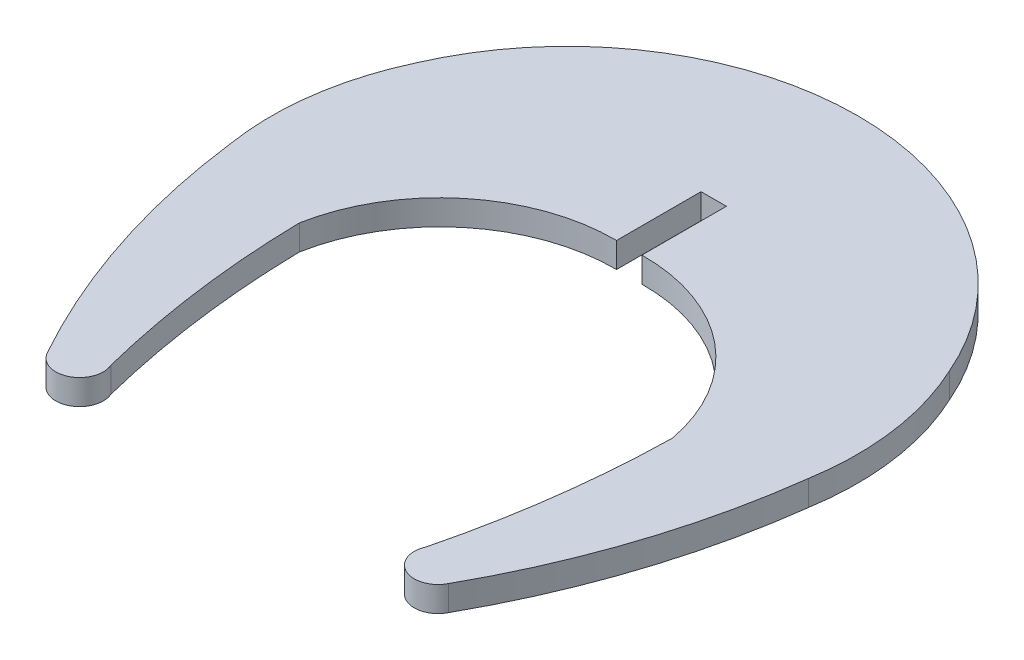
ISO-10303-21;
HEADER;
FILE_DESCRIPTION(('STEP AP214'),'2;1');
FILE_NAME('part.step','',(''),(''),'','','');
FILE_SCHEMA(('AUTOMOTIVE_DESIGN { 1 0 10303 214 1 1 1 1 }'));
ENDSEC;
DATA;
#1=APPLICATION_CONTEXT('core data for automotive mechanical design processes');
#2=APPLICATION_PROTOCOL_DEFINITION('international standard','automotive_design',2000,#1);
#3=PRODUCT_CONTEXT('',#1,'mechanical');
#4=PRODUCT('Part','Part','',(#3));
#5=PRODUCT_RELATED_PRODUCT_CATEGORY('part','',(#4));
#6=PRODUCT_DEFINITION_FORMATION('','',#4);
#7=PRODUCT_DEFINITION_CONTEXT('part definition',#1,'design');
#8=PRODUCT_DEFINITION('design','',#6,#7);
#9=PRODUCT_DEFINITION_SHAPE('','',#8);
#10=(LENGTH_UNIT() NAMED_UNIT(*) SI_UNIT(.MILLI.,.METRE.));
#11=(NAMED_UNIT(*) PLANE_ANGLE_UNIT() SI_UNIT($,.RADIAN.));
#12=(NAMED_UNIT(*) SI_UNIT($,.STERADIAN.) SOLID_ANGLE_UNIT());
#13=UNCERTAINTY_MEASURE_WITH_UNIT(LENGTH_MEASURE(1.E-05),#10,'distance_accuracy_value','');
#14=(GEOMETRIC_REPRESENTATION_CONTEXT(3) GLOBAL_UNCERTAINTY_ASSIGNED_CONTEXT((#13)) GLOBAL_UNIT_ASSIGNED_CONTEXT((#10,
#11,#12)) REPRESENTATION_CONTEXT('',''));
#15=CARTESIAN_POINT('',(0.,0.,0.));
#16=DIRECTION('',(0.,0.,1.));
#17=DIRECTION('',(1.,0.,0.));
#18=AXIS2_PLACEMENT_3D('',#15,#16,#17);
#19=CARTESIAN_POINT('',(188.636356689508,1.45,-369.207133037164));
#20=DIRECTION('',(0.,-1.,0.));
#21=DIRECTION('',(0.,0.,-1.));
#22=AXIS2_PLACEMENT_3D('',#19,#20,#21);
#23=CYLINDRICAL_SURFACE('',#22,43.162337128012);
#24=CARTESIAN_POINT('',(188.636356689508,0.,-369.207133037164));
#25=DIRECTION('',(0.,1.,0.));
#26=DIRECTION('',(0.,0.,1.));
#27=AXIS2_PLACEMENT_3D('',#24,#25,#26);
#28=CIRCLE('',#27,43.162337128012);
#29=CARTESIAN_POINT('',(226.3436208611,0.,-348.203572028471));
#30=VERTEX_POINT('',#29);
#31=CARTESIAN_POINT('',(231.456772393705,0.,-363.785016727837));
#32=VERTEX_POINT('',#31);
#33=EDGE_CURVE('E167',#30,#32,#28,.T.);
#34=ORIENTED_EDGE('',*,*,#33,.T.);
#35=DIRECTION('',(0.,-1.,0.));
#36=VECTOR('',#35,1.);
#37=CARTESIAN_POINT('',(231.456772393705,1.45,-363.785016727837));
#38=LINE('',#37,#36);
#39=CARTESIAN_POINT('',(231.456772393705,1.45,-363.785016727837));
#40=VERTEX_POINT('',#39);
#41=EDGE_CURVE('E11',#40,#32,#38,.T.);
#42=ORIENTED_EDGE('',*,*,#41,.F.);
#43=CARTESIAN_POINT('',(188.636356689508,1.45,-369.207133037164));
#44=DIRECTION('',(0.,1.,0.));
#45=DIRECTION('',(0.,0.,1.));
#46=AXIS2_PLACEMENT_3D('',#43,#44,#45);
#47=CIRCLE('',#46,43.162337128012);
#48=CARTESIAN_POINT('',(226.3436208611,1.45,-348.203572028471));
#49=VERTEX_POINT('',#48);
#50=EDGE_CURVE('E199',#49,#40,#47,.T.);
#51=ORIENTED_EDGE('',*,*,#50,.F.);
#52=DIRECTION('',(0.,-1.,0.));
#53=VECTOR('',#52,1.);
#54=CARTESIAN_POINT('',(226.3436208611,1.45,-348.203572028471));
#55=LINE('',#54,#53);
#56=EDGE_CURVE('E163',#49,#30,#55,.T.);
#57=ORIENTED_EDGE('',*,*,#56,.T.);
#58=EDGE_LOOP('',(#34,#42,#51,#57));
#59=FACE_BOUND('',#58,.T.);
#60=ADVANCED_FACE('F37',(#59),#23,.T.);
#61=CARTESIAN_POINT('',(215.567357151755,1.45,-366.383328136484));
#62=DIRECTION('',(0.,-1.,0.));
#63=DIRECTION('',(0.,0.,-1.));
#64=AXIS2_PLACEMENT_3D('',#61,#62,#63);
#65=CYLINDRICAL_SURFACE('',#64,16.100457723538);
#66=CARTESIAN_POINT('',(215.567357151755,0.,-366.383328136484));
#67=DIRECTION('',(0.,1.,0.));
#68=DIRECTION('',(0.,0.,1.));
#69=AXIS2_PLACEMENT_3D('',#66,#67,#68);
#70=CIRCLE('',#69,16.100457723538);
#71=CARTESIAN_POINT('',(230.152098213253,0.,-373.203157098891));
#72=VERTEX_POINT('',#71);
#73=EDGE_CURVE('E170',#32,#72,#70,.T.);
#74=ORIENTED_EDGE('',*,*,#73,.T.);
#75=DIRECTION('',(0.,-1.,0.));
#76=VECTOR('',#75,1.);
#77=CARTESIAN_POINT('',(230.152098213253,1.45,-373.203157098891));
#78=LINE('',#77,#76);
#79=CARTESIAN_POINT('',(230.152098213253,1.45,-373.203157098891));
#80=VERTEX_POINT('',#79);
#81=EDGE_CURVE('E45',#80,#72,#78,.T.);
#82=ORIENTED_EDGE('',*,*,#81,.F.);
#83=CARTESIAN_POINT('',(215.567357151755,1.45,-366.383328136484));
#84=DIRECTION('',(0.,1.,0.));
#85=DIRECTION('',(0.,0.,1.));
#86=AXIS2_PLACEMENT_3D('',#83,#84,#85);
#87=CIRCLE('',#86,16.100457723538);
#88=EDGE_CURVE('E110',#40,#80,#87,.T.);
#89=ORIENTED_EDGE('',*,*,#88,.F.);
#90=ORIENTED_EDGE('',*,*,#41,.T.);
#91=EDGE_LOOP('',(#74,#82,#89,#90));
#92=FACE_BOUND('',#91,.T.);
#93=ADVANCED_FACE('F280',(#92),#65,.T.);
#94=CARTESIAN_POINT('',(214.813592721454,1.45,-366.553686609815));
#95=DIRECTION('',(0.,-1.,0.));
#96=DIRECTION('',(0.,0.,-1.));
#97=AXIS2_PLACEMENT_3D('',#94,#95,#96);
#98=CYLINDRICAL_SURFACE('',#97,16.717811115904);
#99=CARTESIAN_POINT('',(214.813592721454,0.,-366.553686609815));
#100=DIRECTION('',(0.,1.,0.));
#101=DIRECTION('',(0.,0.,1.));
#102=AXIS2_PLACEMENT_3D('',#99,#100,#101);
#103=CIRCLE('',#102,16.717811115904);
#104=CARTESIAN_POINT('',(199.475086729877,0.,-373.20315594604));
#105=VERTEX_POINT('',#104);
#106=EDGE_CURVE('E172',#72,#105,#103,.T.);
#107=ORIENTED_EDGE('',*,*,#106,.T.);
#108=DIRECTION('',(0.,-1.,0.));
#109=VECTOR('',#108,1.);
#110=CARTESIAN_POINT('',(199.475086729877,1.45,-373.20315594604));
#111=LINE('',#110,#109);
#112=CARTESIAN_POINT('',(199.475086729877,1.45,-373.20315594604));
#113=VERTEX_POINT('',#112);
#114=EDGE_CURVE('E220',#113,#105,#111,.T.);
#115=ORIENTED_EDGE('',*,*,#114,.F.);
#116=CARTESIAN_POINT('',(214.813592721454,1.45,-366.553686609815));
#117=DIRECTION('',(0.,1.,0.));
#118=DIRECTION('',(0.,0.,1.));
#119=AXIS2_PLACEMENT_3D('',#116,#117,#118);
#120=CIRCLE('',#119,16.717811115904);
#121=EDGE_CURVE('E228',#80,#113,#120,.T.);
#122=ORIENTED_EDGE('',*,*,#121,.F.);
#123=ORIENTED_EDGE('',*,*,#81,.T.);
#124=EDGE_LOOP('',(#107,#115,#122,#123));
#125=FACE_BOUND('',#124,.T.);
#126=ADVANCED_FACE('F226',(#125),#98,.T.);
#127=CARTESIAN_POINT('',(214.059828567889,1.45,-366.383328070589));
#128=DIRECTION('',(0.,-1.,0.));
#129=DIRECTION('',(0.,0.,-1.));
#130=AXIS2_PLACEMENT_3D('',#127,#128,#129);
#131=CYLINDRICAL_SURFACE('',#130,16.100457966538);
#132=CARTESIAN_POINT('',(214.059828567889,0.,-366.383328070589));
#133=DIRECTION('',(0.,1.,0.));
#134=DIRECTION('',(0.,0.,1.));
#135=AXIS2_PLACEMENT_3D('',#132,#133,#134);
#136=CIRCLE('',#135,16.100457966538);
#137=CARTESIAN_POINT('',(198.17041332637,0.,-363.785015153553));
#138=VERTEX_POINT('',#137);
#139=EDGE_CURVE('E174',#105,#138,#136,.T.);
#140=ORIENTED_EDGE('',*,*,#139,.T.);
#141=DIRECTION('',(0.,-1.,0.));
#142=VECTOR('',#141,1.);
#143=CARTESIAN_POINT('',(198.17041332637,1.45,-363.785015153553));
#144=LINE('',#143,#142);
#145=CARTESIAN_POINT('',(198.17041332637,1.45,-363.785015153553));
#146=VERTEX_POINT('',#145);
#147=EDGE_CURVE('E217',#146,#138,#144,.T.);
#148=ORIENTED_EDGE('',*,*,#147,.F.);
#149=CARTESIAN_POINT('',(214.059828567889,1.45,-366.383328070589));
#150=DIRECTION('',(0.,1.,0.));
#151=DIRECTION('',(0.,0.,1.));
#152=AXIS2_PLACEMENT_3D('',#149,#150,#151);
#153=CIRCLE('',#152,16.100457966538);
#154=EDGE_CURVE('E246',#113,#146,#153,.T.);
#155=ORIENTED_EDGE('',*,*,#154,.F.);
#156=ORIENTED_EDGE('',*,*,#114,.T.);
#157=EDGE_LOOP('',(#140,#148,#155,#156));
#158=FACE_BOUND('',#157,.T.);
#159=ADVANCED_FACE('F237',(#158),#131,.T.);
#160=CARTESIAN_POINT('',(240.990829159238,1.45,-369.207132381104));
#161=DIRECTION('',(0.,-1.,0.));
#162=DIRECTION('',(0.,0.,-1.));
#163=AXIS2_PLACEMENT_3D('',#160,#161,#162);
#164=CYLINDRICAL_SURFACE('',#163,43.162337371012);
#165=CARTESIAN_POINT('',(240.990829159238,0.,-369.207132381104));
#166=DIRECTION('',(0.,1.,0.));
#167=DIRECTION('',(0.,0.,1.));
#168=AXIS2_PLACEMENT_3D('',#165,#166,#167);
#169=CIRCLE('',#168,43.162337371012);
#170=CARTESIAN_POINT('',(203.283563129475,0.,-348.203574208981));
#171=VERTEX_POINT('',#170);
#172=EDGE_CURVE('E176',#138,#171,#169,.T.);
#173=ORIENTED_EDGE('',*,*,#172,.T.);
#174=DIRECTION('',(0.,-1.,0.));
#175=VECTOR('',#174,1.);
#176=CARTESIAN_POINT('',(203.283563129475,1.45,-348.203574208981));
#177=LINE('',#176,#175);
#178=CARTESIAN_POINT('',(203.283563129475,1.45,-348.203574208981));
#179=VERTEX_POINT('',#178);
#180=EDGE_CURVE('E214',#179,#171,#177,.T.);
#181=ORIENTED_EDGE('',*,*,#180,.F.);
#182=CARTESIAN_POINT('',(240.990829159238,1.45,-369.207132381104));
#183=DIRECTION('',(0.,1.,0.));
#184=DIRECTION('',(0.,0.,1.));
#185=AXIS2_PLACEMENT_3D('',#182,#183,#184);
#186=CIRCLE('',#185,43.162337371012);
#187=EDGE_CURVE('E243',#146,#179,#186,.T.);
#188=ORIENTED_EDGE('',*,*,#187,.F.);
#189=ORIENTED_EDGE('',*,*,#147,.T.);
#190=EDGE_LOOP('',(#173,#181,#188,#189));
#191=FACE_BOUND('',#190,.T.);
#192=ADVANCED_FACE('F241',(#191),#164,.T.);
#193=CARTESIAN_POINT('',(204.504357975467,1.45,-348.820074654792));
#194=DIRECTION('',(0.,-1.,0.));
#195=DIRECTION('',(0.,0.,-1.));
#196=AXIS2_PLACEMENT_3D('',#193,#194,#195);
#197=CYLINDRICAL_SURFACE('',#196,1.36763037977548);
#198=CARTESIAN_POINT('',(204.504357975467,0.,-348.820074654792));
#199=DIRECTION('',(0.,1.,0.));
#200=DIRECTION('',(0.,0.,1.));
#201=AXIS2_PLACEMENT_3D('',#198,#199,#200);
#202=CIRCLE('',#201,1.36763037977548);
#203=CARTESIAN_POINT('',(205.756361413926,0.,-349.370438394306));
#204=VERTEX_POINT('',#203);
#205=EDGE_CURVE('E178',#171,#204,#202,.T.);
#206=ORIENTED_EDGE('',*,*,#205,.T.);
#207=DIRECTION('',(0.,-1.,0.));
#208=VECTOR('',#207,1.);
#209=CARTESIAN_POINT('',(205.756361413926,1.45,-349.370438394306));
#210=LINE('',#209,#208);
#211=CARTESIAN_POINT('',(205.756361413926,1.45,-349.370438394306));
#212=VERTEX_POINT('',#211);
#213=EDGE_CURVE('E212',#212,#204,#210,.T.);
#214=ORIENTED_EDGE('',*,*,#213,.F.);
#215=CARTESIAN_POINT('',(204.504357975467,1.45,-348.820074654792));
#216=DIRECTION('',(0.,1.,0.));
#217=DIRECTION('',(0.,0.,1.));
#218=AXIS2_PLACEMENT_3D('',#215,#216,#217);
#219=CIRCLE('',#218,1.36763037977548);
#220=EDGE_CURVE('E245',#179,#212,#219,.T.);
#221=ORIENTED_EDGE('',*,*,#220,.F.);
#222=ORIENTED_EDGE('',*,*,#180,.T.);
#223=EDGE_LOOP('',(#206,#214,#221,#222));
#224=FACE_BOUND('',#223,.T.);
#225=ADVANCED_FACE('F293',(#224),#197,.T.);
#226=CARTESIAN_POINT('',(259.331491762557,1.45,-362.877665467316));
#227=DIRECTION('',(0.,-1.,0.));
#228=DIRECTION('',(0.,0.,-1.));
#229=AXIS2_PLACEMENT_3D('',#226,#227,#228);
#230=CYLINDRICAL_SURFACE('',#229,55.251604276027);
#231=CARTESIAN_POINT('',(259.331491762557,0.,-362.877665467316));
#232=DIRECTION('',(0.,1.,0.));
#233=DIRECTION('',(0.,0.,1.));
#234=AXIS2_PLACEMENT_3D('',#231,#232,#233);
#235=CIRCLE('',#234,55.251604276027);
#236=CARTESIAN_POINT('',(204.089064267255,0.,-361.87069997586));
#237=VERTEX_POINT('',#236);
#238=EDGE_CURVE('E181',#237,#204,#235,.T.);
#239=ORIENTED_EDGE('',*,*,#238,.F.);
#240=DIRECTION('',(0.,-1.,0.));
#241=VECTOR('',#240,1.);
#242=CARTESIAN_POINT('',(204.089064267255,1.45,-361.87069997586));
#243=LINE('',#242,#241);
#244=CARTESIAN_POINT('',(204.089064267255,1.45,-361.87069997586));
#245=VERTEX_POINT('',#244);
#246=EDGE_CURVE('E210',#245,#237,#243,.T.);
#247=ORIENTED_EDGE('',*,*,#246,.F.);
#248=CARTESIAN_POINT('',(259.331491762557,1.45,-362.877665467316));
#249=DIRECTION('',(0.,1.,0.));
#250=DIRECTION('',(0.,0.,1.));
#251=AXIS2_PLACEMENT_3D('',#248,#249,#250);
#252=CIRCLE('',#251,55.251604276027);
#253=EDGE_CURVE('E248',#245,#212,#252,.T.);
#254=ORIENTED_EDGE('',*,*,#253,.T.);
#255=ORIENTED_EDGE('',*,*,#213,.T.);
#256=EDGE_LOOP('',(#239,#247,#254,#255));
#257=FACE_BOUND('',#256,.T.);
#258=ADVANCED_FACE('F296',(#257),#230,.F.);
#259=CARTESIAN_POINT('',(214.0043085446,1.45,-360.04085403893));
#260=DIRECTION('',(0.,-1.,0.));
#261=DIRECTION('',(0.,0.,-1.));
#262=AXIS2_PLACEMENT_3D('',#259,#260,#261);
#263=CYLINDRICAL_SURFACE('',#262,10.0826784751039);
#264=CARTESIAN_POINT('',(214.0043085446,0.,-360.04085403893));
#265=DIRECTION('',(0.,1.,0.));
#266=DIRECTION('',(0.,0.,1.));
#267=AXIS2_PLACEMENT_3D('',#264,#265,#266);
#268=CIRCLE('',#267,10.0826784751039);
#269=CARTESIAN_POINT('',(214.084591262165,0.,-370.123212885826));
#270=VERTEX_POINT('',#269);
#271=EDGE_CURVE('E184',#270,#237,#268,.T.);
#272=ORIENTED_EDGE('',*,*,#271,.F.);
#273=DIRECTION('',(0.,-1.,0.));
#274=VECTOR('',#273,1.);
#275=CARTESIAN_POINT('',(214.084591262165,1.45,-370.123212885826));
#276=LINE('',#275,#274);
#277=CARTESIAN_POINT('',(214.084591262165,1.45,-370.123212885826));
#278=VERTEX_POINT('',#277);
#279=EDGE_CURVE('E208',#278,#270,#276,.T.);
#280=ORIENTED_EDGE('',*,*,#279,.F.);
#281=CARTESIAN_POINT('',(214.0043085446,1.45,-360.04085403893));
#282=DIRECTION('',(0.,1.,0.));
#283=DIRECTION('',(0.,0.,1.));
#284=AXIS2_PLACEMENT_3D('',#281,#282,#283);
#285=CIRCLE('',#284,10.0826784751039);
#286=EDGE_CURVE('E255',#278,#245,#285,.T.);
#287=ORIENTED_EDGE('',*,*,#286,.T.);
#288=ORIENTED_EDGE('',*,*,#246,.T.);
#289=EDGE_LOOP('',(#272,#280,#287,#288));
#290=FACE_BOUND('',#289,.T.);
#291=ADVANCED_FACE('F300',(#290),#263,.F.);
#292=CARTESIAN_POINT('',(214.084581825399,1.45,-266.9066467264));
#293=DIRECTION('',(-0.999999999999996,0.,-9.14268558127771E-08));
#294=DIRECTION('',(-9.14268558127771E-08,0.,0.999999999999996));
#295=AXIS2_PLACEMENT_3D('',#292,#293,#294);
#296=PLANE('',#295);
#297=DIRECTION('',(9.14268558127771E-08,0.,-0.999999999999996));
#298=VECTOR('',#297,1.);
#299=CARTESIAN_POINT('',(214.084581825399,0.,-266.9066467264));
#300=LINE('',#299,#298);
#301=CARTESIAN_POINT('',(214.0845917065,0.,-374.98321859239));
#302=VERTEX_POINT('',#301);
#303=EDGE_CURVE('E187',#270,#302,#300,.T.);
#304=ORIENTED_EDGE('',*,*,#303,.T.);
#305=DIRECTION('',(0.,-1.,0.));
#306=VECTOR('',#305,1.);
#307=CARTESIAN_POINT('',(214.0845917065,1.45,-374.98321859239));
#308=LINE('',#307,#306);
#309=CARTESIAN_POINT('',(214.0845917065,1.45,-374.98321859239));
#310=VERTEX_POINT('',#309);
#311=EDGE_CURVE('E205',#310,#302,#308,.T.);
#312=ORIENTED_EDGE('',*,*,#311,.F.);
#313=DIRECTION('',(9.14268558127771E-08,0.,-0.999999999999996));
#314=VECTOR('',#313,1.);
#315=CARTESIAN_POINT('',(214.084581825399,1.45,-266.9066467264));
#316=LINE('',#315,#314);
#317=EDGE_CURVE('E258',#278,#310,#316,.T.);
#318=ORIENTED_EDGE('',*,*,#317,.F.);
#319=ORIENTED_EDGE('',*,*,#279,.T.);
#320=EDGE_LOOP('',(#304,#312,#318,#319));
#321=FACE_BOUND('',#320,.T.);
#322=ADVANCED_FACE('F304',(#321),#296,.F.);
#323=CARTESIAN_POINT('',(-48.360559474051,1.45,-374.98321859239));
#324=DIRECTION('',(0.,0.,-1.));
#325=DIRECTION('',(-1.,0.,0.));
#326=AXIS2_PLACEMENT_3D('',#323,#324,#325);
#327=PLANE('',#326);
#328=DIRECTION('',(1.,0.,0.));
#329=VECTOR('',#328,1.);
#330=CARTESIAN_POINT('',(-48.360559474051,0.,-374.98321859239));
#331=LINE('',#330,#329);
#332=CARTESIAN_POINT('',(215.542593647966,0.,-374.98321859239));
#333=VERTEX_POINT('',#332);
#334=EDGE_CURVE('E189',#302,#333,#331,.T.);
#335=ORIENTED_EDGE('',*,*,#334,.T.);
#336=DIRECTION('',(0.,-1.,0.));
#337=VECTOR('',#336,1.);
#338=CARTESIAN_POINT('',(215.542593647966,1.45,-374.98321859239));
#339=LINE('',#338,#337);
#340=CARTESIAN_POINT('',(215.542593647966,1.45,-374.98321859239));
#341=VERTEX_POINT('',#340);
#342=EDGE_CURVE('E203',#341,#333,#339,.T.);
#343=ORIENTED_EDGE('',*,*,#342,.F.);
#344=DIRECTION('',(1.,0.,0.));
#345=VECTOR('',#344,1.);
#346=CARTESIAN_POINT('',(-48.360559474051,1.45,-374.98321859239));
#347=LINE('',#346,#345);
#348=EDGE_CURVE('E260',#310,#341,#347,.T.);
#349=ORIENTED_EDGE('',*,*,#348,.F.);
#350=ORIENTED_EDGE('',*,*,#311,.T.);
#351=EDGE_LOOP('',(#335,#343,#349,#350));
#352=FACE_BOUND('',#351,.T.);
#353=ADVANCED_FACE('F308',(#352),#327,.F.);
#354=CARTESIAN_POINT('',(215.542581540349,1.45,-266.906641156358));
#355=DIRECTION('',(-0.999999999999994,0.,-1.12028132714152E-07));
#356=DIRECTION('',(-1.12028132714152E-07,0.,0.999999999999994));
#357=AXIS2_PLACEMENT_3D('',#354,#355,#356);
#358=PLANE('',#357);
#359=DIRECTION('',(1.12028132714152E-07,0.,-0.999999999999994));
#360=VECTOR('',#359,1.);
#361=CARTESIAN_POINT('',(215.542581540349,0.,-266.906641156358));
#362=LINE('',#361,#360);
#363=CARTESIAN_POINT('',(215.542593103509,0.,-370.123212851972));
#364=VERTEX_POINT('',#363);
#365=EDGE_CURVE('E192',#364,#333,#362,.T.);
#366=ORIENTED_EDGE('',*,*,#365,.F.);
#367=DIRECTION('',(0.,-1.,0.));
#368=VECTOR('',#367,1.);
#369=CARTESIAN_POINT('',(215.542593103509,1.45,-370.123212851972));
#370=LINE('',#369,#368);
#371=CARTESIAN_POINT('',(215.542593103509,1.45,-370.123212851972));
#372=VERTEX_POINT('',#371);
#373=EDGE_CURVE('E153',#372,#364,#370,.T.);
#374=ORIENTED_EDGE('',*,*,#373,.F.);
#375=DIRECTION('',(1.12028132714152E-07,0.,-0.999999999999994));
#376=VECTOR('',#375,1.);
#377=CARTESIAN_POINT('',(215.542581540349,1.45,-266.906641156358));
#378=LINE('',#377,#376);
#379=EDGE_CURVE('E159',#372,#341,#378,.T.);
#380=ORIENTED_EDGE('',*,*,#379,.T.);
#381=ORIENTED_EDGE('',*,*,#342,.T.);
#382=EDGE_LOOP('',(#366,#374,#380,#381));
#383=FACE_BOUND('',#382,.T.);
#384=ADVANCED_FACE('F263',(#383),#358,.T.);
#385=CARTESIAN_POINT('',(215.622876858836,1.45,-360.04085401334));
#386=DIRECTION('',(0.,-1.,0.));
#387=DIRECTION('',(0.,0.,-1.));
#388=AXIS2_PLACEMENT_3D('',#385,#386,#387);
#389=CYLINDRICAL_SURFACE('',#388,10.082678475104);
#390=CARTESIAN_POINT('',(215.622876858836,0.,-360.04085401334));
#391=DIRECTION('',(0.,1.,0.));
#392=DIRECTION('',(0.,0.,1.));
#393=AXIS2_PLACEMENT_3D('',#390,#391,#392);
#394=CIRCLE('',#393,10.082678475104);
#395=CARTESIAN_POINT('',(225.538120971566,0.,-361.870700842261));
#396=VERTEX_POINT('',#395);
#397=EDGE_CURVE('E148',#396,#364,#394,.T.);
#398=ORIENTED_EDGE('',*,*,#397,.F.);
#399=DIRECTION('',(0.,-1.,0.));
#400=VECTOR('',#399,1.);
#401=CARTESIAN_POINT('',(225.538120971566,1.45,-361.870700842261));
#402=LINE('',#401,#400);
#403=CARTESIAN_POINT('',(225.538120971566,1.45,-361.870700842261));
#404=VERTEX_POINT('',#403);
#405=EDGE_CURVE('E143',#404,#396,#402,.T.);
#406=ORIENTED_EDGE('',*,*,#405,.F.);
#407=CARTESIAN_POINT('',(215.622876858836,1.45,-360.04085401334));
#408=DIRECTION('',(0.,1.,0.));
#409=DIRECTION('',(0.,0.,1.));
#410=AXIS2_PLACEMENT_3D('',#407,#408,#409);
#411=CIRCLE('',#410,10.082678475104);
#412=EDGE_CURVE('E146',#404,#372,#411,.T.);
#413=ORIENTED_EDGE('',*,*,#412,.T.);
#414=ORIENTED_EDGE('',*,*,#373,.T.);
#415=EDGE_LOOP('',(#398,#406,#413,#414));
#416=FACE_BOUND('',#415,.T.);
#417=ADVANCED_FACE('F145',(#416),#389,.F.);
#418=CARTESIAN_POINT('',(170.295693430816,1.45,-362.877663840475));
#419=DIRECTION('',(0.,-1.,0.));
#420=DIRECTION('',(0.,0.,-1.));
#421=AXIS2_PLACEMENT_3D('',#418,#419,#420);
#422=CYLINDRICAL_SURFACE('',#421,55.251604276027);
#423=CARTESIAN_POINT('',(170.295693430816,0.,-362.877663840475));
#424=DIRECTION('',(0.,1.,0.));
#425=DIRECTION('',(0.,0.,1.));
#426=AXIS2_PLACEMENT_3D('',#423,#424,#425);
#427=CIRCLE('',#426,55.251604276027);
#428=CARTESIAN_POINT('',(223.870823004813,0.,-349.370433694949));
#429=VERTEX_POINT('',#428);
#430=EDGE_CURVE('E196',#429,#396,#427,.T.);
#431=ORIENTED_EDGE('',*,*,#430,.F.);
#432=DIRECTION('',(0.,-1.,0.));
#433=VECTOR('',#432,1.);
#434=CARTESIAN_POINT('',(223.870823004813,1.45,-349.370433694949));
#435=LINE('',#434,#433);
#436=CARTESIAN_POINT('',(223.870823004813,1.45,-349.370433694949));
#437=VERTEX_POINT('',#436);
#438=EDGE_CURVE('E99',#437,#429,#435,.T.);
#439=ORIENTED_EDGE('',*,*,#438,.F.);
#440=CARTESIAN_POINT('',(170.295693430816,1.45,-362.877663840475));
#441=DIRECTION('',(0.,1.,0.));
#442=DIRECTION('',(0.,0.,1.));
#443=AXIS2_PLACEMENT_3D('',#440,#441,#442);
#444=CIRCLE('',#443,55.251604276027);
#445=EDGE_CURVE('E157',#437,#404,#444,.T.);
#446=ORIENTED_EDGE('',*,*,#445,.T.);
#447=ORIENTED_EDGE('',*,*,#405,.T.);
#448=EDGE_LOOP('',(#431,#439,#446,#447));
#449=FACE_BOUND('',#448,.T.);
#450=ADVANCED_FACE('F161',(#449),#422,.F.);
#451=CARTESIAN_POINT('',(225.122829931697,1.45,-348.820079126821));
#452=DIRECTION('',(0.,-1.,0.));
#453=DIRECTION('',(0.,0.,-1.));
#454=AXIS2_PLACEMENT_3D('',#451,#452,#453);
#455=CYLINDRICAL_SURFACE('',#454,1.36762988254392);
#456=CARTESIAN_POINT('',(225.122829931697,0.,-348.820079126821));
#457=DIRECTION('',(0.,1.,0.));
#458=DIRECTION('',(0.,0.,1.));
#459=AXIS2_PLACEMENT_3D('',#456,#457,#458);
#460=CIRCLE('',#459,1.36762988254392);
#461=EDGE_CURVE('E102',#429,#30,#460,.T.);
#462=ORIENTED_EDGE('',*,*,#461,.T.);
#463=ORIENTED_EDGE('',*,*,#56,.F.);
#464=CARTESIAN_POINT('',(225.122829931697,1.45,-348.820079126821));
#465=DIRECTION('',(0.,1.,0.));
#466=DIRECTION('',(0.,0.,1.));
#467=AXIS2_PLACEMENT_3D('',#464,#465,#466);
#468=CIRCLE('',#467,1.36762988254392);
#469=EDGE_CURVE('E53',#437,#49,#468,.T.);
#470=ORIENTED_EDGE('',*,*,#469,.F.);
#471=ORIENTED_EDGE('',*,*,#438,.T.);
#472=EDGE_LOOP('',(#462,#463,#470,#471));
#473=FACE_BOUND('',#472,.T.);
#474=ADVANCED_FACE('F269',(#473),#455,.T.);
#475=CARTESIAN_POINT('',(-48.360559474051,1.45,-266.906670720934));
#476=DIRECTION('',(0.,1.,0.));
#477=DIRECTION('',(0.,0.,1.));
#478=AXIS2_PLACEMENT_3D('',#475,#476,#477);
#479=PLANE('',#478);
#480=ORIENTED_EDGE('',*,*,#50,.T.);
#481=ORIENTED_EDGE('',*,*,#88,.T.);
#482=ORIENTED_EDGE('',*,*,#121,.T.);
#483=ORIENTED_EDGE('',*,*,#154,.T.);
#484=ORIENTED_EDGE('',*,*,#187,.T.);
#485=ORIENTED_EDGE('',*,*,#220,.T.);
#486=ORIENTED_EDGE('',*,*,#253,.F.);
#487=ORIENTED_EDGE('',*,*,#286,.F.);
#488=ORIENTED_EDGE('',*,*,#317,.T.);
#489=ORIENTED_EDGE('',*,*,#348,.T.);
#490=ORIENTED_EDGE('',*,*,#379,.F.);
#491=ORIENTED_EDGE('',*,*,#412,.F.);
#492=ORIENTED_EDGE('',*,*,#445,.F.);
#493=ORIENTED_EDGE('',*,*,#469,.T.);
#494=EDGE_LOOP('',(#480,#481,#482,#483,#484,#485,#486,#487,#488,#489,#490,#491,#492,#493));
#495=FACE_BOUND('',#494,.T.);
#496=ADVANCED_FACE('F156',(#495),#479,.T.);
#497=CARTESIAN_POINT('',(-48.360559474051,0.,-266.906670720934));
#498=DIRECTION('',(0.,1.,0.));
#499=DIRECTION('',(0.,0.,1.));
#500=AXIS2_PLACEMENT_3D('',#497,#498,#499);
#501=PLANE('',#500);
#502=ORIENTED_EDGE('',*,*,#33,.F.);
#503=ORIENTED_EDGE('',*,*,#461,.F.);
#504=ORIENTED_EDGE('',*,*,#430,.T.);
#505=ORIENTED_EDGE('',*,*,#397,.T.);
#506=ORIENTED_EDGE('',*,*,#365,.T.);
#507=ORIENTED_EDGE('',*,*,#334,.F.);
#508=ORIENTED_EDGE('',*,*,#303,.F.);
#509=ORIENTED_EDGE('',*,*,#271,.T.);
#510=ORIENTED_EDGE('',*,*,#238,.T.);
#511=ORIENTED_EDGE('',*,*,#205,.F.);
#512=ORIENTED_EDGE('',*,*,#172,.F.);
#513=ORIENTED_EDGE('',*,*,#139,.F.);
#514=ORIENTED_EDGE('',*,*,#106,.F.);
#515=ORIENTED_EDGE('',*,*,#73,.F.);
#516=EDGE_LOOP('',(#502,#503,#504,#505,#506,#507,#508,#509,#510,#511,#512,#513,#514,#515));
#517=FACE_BOUND('',#516,.T.);
#518=ADVANCED_FACE('F232',(#517),#501,.F.);
#519=CLOSED_SHELL('',(#60,#93,#126,#159,#192,#225,#258,#291,#322,#353,#384,#417,#450,#474,#496,#518));
#520=MANIFOLD_SOLID_BREP('B2',#519);
#521=ADVANCED_BREP_SHAPE_REPRESENTATION('',(#18,#520),#14);
#522=SHAPE_DEFINITION_REPRESENTATION(#9,#521);
ENDSEC;
END-ISO-10303-21;
